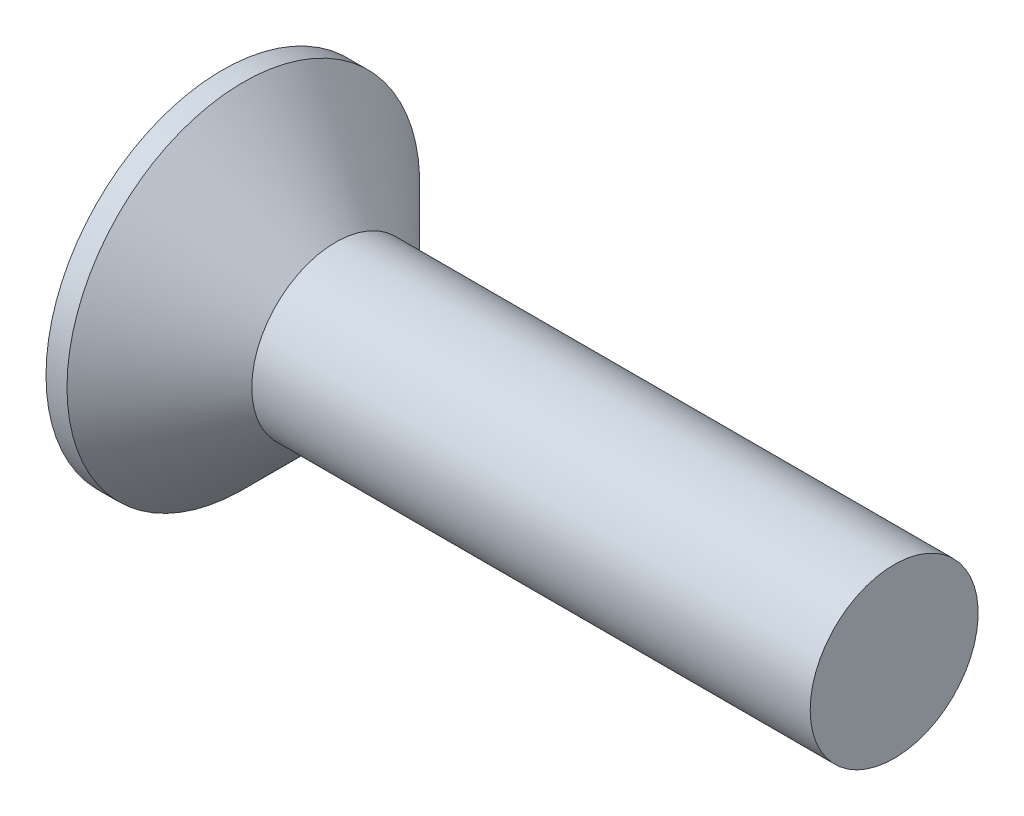
ISO-10303-21;
HEADER;
FILE_DESCRIPTION(('STEP AP214'),'2;1');
FILE_NAME('part.step','',(''),(''),'','','');
FILE_SCHEMA(('AUTOMOTIVE_DESIGN { 1 0 10303 214 1 1 1 1 }'));
ENDSEC;
DATA;
#1=APPLICATION_CONTEXT('core data for automotive mechanical design processes');
#2=APPLICATION_PROTOCOL_DEFINITION('international standard','automotive_design',2000,#1);
#3=PRODUCT_CONTEXT('',#1,'mechanical');
#4=PRODUCT('Part','Part','',(#3));
#5=PRODUCT_RELATED_PRODUCT_CATEGORY('part','',(#4));
#6=PRODUCT_DEFINITION_FORMATION('','',#4);
#7=PRODUCT_DEFINITION_CONTEXT('part definition',#1,'design');
#8=PRODUCT_DEFINITION('design','',#6,#7);
#9=PRODUCT_DEFINITION_SHAPE('','',#8);
#10=(LENGTH_UNIT() NAMED_UNIT(*) SI_UNIT(.MILLI.,.METRE.));
#11=(NAMED_UNIT(*) PLANE_ANGLE_UNIT() SI_UNIT($,.RADIAN.));
#12=(NAMED_UNIT(*) SI_UNIT($,.STERADIAN.) SOLID_ANGLE_UNIT());
#13=UNCERTAINTY_MEASURE_WITH_UNIT(LENGTH_MEASURE(1.E-05),#10,'distance_accuracy_value','');
#14=(GEOMETRIC_REPRESENTATION_CONTEXT(3) GLOBAL_UNCERTAINTY_ASSIGNED_CONTEXT((#13)) GLOBAL_UNIT_ASSIGNED_CONTEXT((#10,
#11,#12)) REPRESENTATION_CONTEXT('',''));
#15=CARTESIAN_POINT('',(0.,0.,0.));
#16=DIRECTION('',(0.,0.,1.));
#17=DIRECTION('',(1.,0.,0.));
#18=AXIS2_PLACEMENT_3D('',#15,#16,#17);
#19=CARTESIAN_POINT('',(0.,0.,0.));
#20=DIRECTION('',(-1.,0.,0.));
#21=DIRECTION('',(0.,0.,1.));
#22=AXIS2_PLACEMENT_3D('',#19,#20,#21);
#23=PLANE('',#22);
#24=CARTESIAN_POINT('',(0.,0.,0.));
#25=DIRECTION('',(-1.,0.,0.));
#26=DIRECTION('',(0.,0.,1.));
#27=AXIS2_PLACEMENT_3D('',#24,#25,#26);
#28=CIRCLE('',#27,4.2);
#29=CARTESIAN_POINT('',(0.,0.,4.2));
#30=VERTEX_POINT('',#29);
#31=EDGE_CURVE('E45',#30,#30,#28,.T.);
#32=ORIENTED_EDGE('',*,*,#31,.T.);
#33=EDGE_LOOP('',(#32));
#34=FACE_BOUND('',#33,.T.);
#35=DIRECTION('',(0.,1.,0.));
#36=VECTOR('',#35,1.);
#37=CARTESIAN_POINT('',(0.,-2.23,-0.48));
#38=LINE('',#37,#36);
#39=CARTESIAN_POINT('',(0.,-2.23,-0.48));
#40=VERTEX_POINT('',#39);
#41=CARTESIAN_POINT('',(0.,-0.479999999999998,-0.48));
#42=VERTEX_POINT('',#41);
#43=EDGE_CURVE('E106',#40,#42,#38,.T.);
#44=ORIENTED_EDGE('',*,*,#43,.T.);
#45=DIRECTION('',(0.,0.,-1.));
#46=VECTOR('',#45,1.);
#47=CARTESIAN_POINT('',(0.,-0.480000000000008,2.23));
#48=LINE('',#47,#46);
#49=CARTESIAN_POINT('',(0.,-0.479999999999992,-2.23));
#50=VERTEX_POINT('',#49);
#51=EDGE_CURVE('E86',#42,#50,#48,.T.);
#52=ORIENTED_EDGE('',*,*,#51,.T.);
#53=DIRECTION('',(0.,1.,0.));
#54=VECTOR('',#53,1.);
#55=CARTESIAN_POINT('',(0.,-0.479999999999992,-2.23));
#56=LINE('',#55,#54);
#57=CARTESIAN_POINT('',(0.,0.480000000000008,-2.23));
#58=VERTEX_POINT('',#57);
#59=EDGE_CURVE('E345',#50,#58,#56,.T.);
#60=ORIENTED_EDGE('',*,*,#59,.T.);
#61=DIRECTION('',(0.,0.,1.));
#62=VECTOR('',#61,1.);
#63=CARTESIAN_POINT('',(0.,0.480000000000008,-2.23));
#64=LINE('',#63,#62);
#65=CARTESIAN_POINT('',(0.,0.480000000000001,-0.48));
#66=VERTEX_POINT('',#65);
#67=EDGE_CURVE('E102',#58,#66,#64,.T.);
#68=ORIENTED_EDGE('',*,*,#67,.T.);
#69=CARTESIAN_POINT('',(0.,2.23,-0.48));
#70=VERTEX_POINT('',#69);
#71=EDGE_CURVE('E96',#66,#70,#38,.T.);
#72=ORIENTED_EDGE('',*,*,#71,.T.);
#73=DIRECTION('',(0.,0.,1.));
#74=VECTOR('',#73,1.);
#75=CARTESIAN_POINT('',(0.,2.23,-0.48));
#76=LINE('',#75,#74);
#77=CARTESIAN_POINT('',(0.,2.23,0.48));
#78=VERTEX_POINT('',#77);
#79=EDGE_CURVE('E99',#70,#78,#76,.T.);
#80=ORIENTED_EDGE('',*,*,#79,.T.);
#81=DIRECTION('',(0.,-1.,0.));
#82=VECTOR('',#81,1.);
#83=CARTESIAN_POINT('',(0.,2.23,0.48));
#84=LINE('',#83,#82);
#85=CARTESIAN_POINT('',(0.,0.479999999999998,0.48));
#86=VERTEX_POINT('',#85);
#87=EDGE_CURVE('E357',#78,#86,#84,.T.);
#88=ORIENTED_EDGE('',*,*,#87,.T.);
#89=CARTESIAN_POINT('',(0.,0.479999999999992,2.23));
#90=VERTEX_POINT('',#89);
#91=EDGE_CURVE('E340',#86,#90,#64,.T.);
#92=ORIENTED_EDGE('',*,*,#91,.T.);
#93=DIRECTION('',(0.,-1.,0.));
#94=VECTOR('',#93,1.);
#95=CARTESIAN_POINT('',(0.,0.479999999999992,2.23));
#96=LINE('',#95,#94);
#97=CARTESIAN_POINT('',(0.,-0.480000000000008,2.23));
#98=VERTEX_POINT('',#97);
#99=EDGE_CURVE('E326',#90,#98,#96,.T.);
#100=ORIENTED_EDGE('',*,*,#99,.T.);
#101=CARTESIAN_POINT('',(0.,-0.480000000000002,0.48));
#102=VERTEX_POINT('',#101);
#103=EDGE_CURVE('E338',#98,#102,#48,.T.);
#104=ORIENTED_EDGE('',*,*,#103,.T.);
#105=CARTESIAN_POINT('',(0.,-2.23,0.48));
#106=VERTEX_POINT('',#105);
#107=EDGE_CURVE('E112',#102,#106,#84,.T.);
#108=ORIENTED_EDGE('',*,*,#107,.T.);
#109=DIRECTION('',(0.,0.,-1.));
#110=VECTOR('',#109,1.);
#111=CARTESIAN_POINT('',(0.,-2.23,0.48));
#112=LINE('',#111,#110);
#113=EDGE_CURVE('E135',#106,#40,#112,.T.);
#114=ORIENTED_EDGE('',*,*,#113,.T.);
#115=EDGE_LOOP('',(#44,#52,#60,#68,#72,#80,#88,#92,#100,#104,#108,#114));
#116=FACE_BOUND('',#115,.T.);
#117=ADVANCED_FACE('F38',(#34,#116),#23,.T.);
#118=CARTESIAN_POINT('',(2.96959798994975,0.,0.211055276381909));
#119=DIRECTION('',(-0.0901968863789278,0.,-0.995923953767328));
#120=DIRECTION('',(-0.995923953767328,0.,0.0901968863789278));
#121=AXIS2_PLACEMENT_3D('',#118,#119,#120);
#122=PLANE('',#121);
#123=ORIENTED_EDGE('',*,*,#107,.F.);
#124=DIRECTION('',(0.991897347093265,0.0898322125669375,-0.0898322125669372));
#125=VECTOR('',#124,1.);
#126=CARTESIAN_POINT('',(2.98840392964726,-0.209352096937608,0.209352096937607));
#127=LINE('',#126,#125);
#128=CARTESIAN_POINT('',(2.65,-0.240000000000001,0.239999999999999));
#129=VERTEX_POINT('',#128);
#130=EDGE_CURVE('E130',#102,#129,#127,.T.);
#131=ORIENTED_EDGE('',*,*,#130,.T.);
#132=DIRECTION('',(0.797549052549738,0.59891419417886,-0.0722308575894103));
#133=VECTOR('',#132,1.);
#134=CARTESIAN_POINT('',(0.,-2.23,0.48));
#135=LINE('',#134,#133);
#136=EDGE_CURVE('E107',#106,#129,#135,.T.);
#137=ORIENTED_EDGE('',*,*,#136,.F.);
#138=EDGE_LOOP('',(#123,#131,#137));
#139=FACE_BOUND('',#138,.T.);
#140=ADVANCED_FACE('F158',(#139),#122,.T.);
#141=DIRECTION('',(0.797549052549738,-0.59891419417886,-0.0722308575894102));
#142=VECTOR('',#141,1.);
#143=CARTESIAN_POINT('',(0.,2.23,0.48));
#144=LINE('',#143,#142);
#145=CARTESIAN_POINT('',(2.65,0.24,0.24));
#146=VERTEX_POINT('',#145);
#147=EDGE_CURVE('E52',#78,#146,#144,.T.);
#148=ORIENTED_EDGE('',*,*,#147,.T.);
#149=DIRECTION('',(-0.991897347093265,0.0898322125669368,0.0898322125669372));
#150=VECTOR('',#149,1.);
#151=CARTESIAN_POINT('',(2.98840392964726,0.209352096937606,0.209352096937607));
#152=LINE('',#151,#150);
#153=EDGE_CURVE('E353',#146,#86,#152,.T.);
#154=ORIENTED_EDGE('',*,*,#153,.T.);
#155=ORIENTED_EDGE('',*,*,#87,.F.);
#156=EDGE_LOOP('',(#148,#154,#155));
#157=FACE_BOUND('',#156,.T.);
#158=ADVANCED_FACE('F162',(#157),#122,.T.);
#159=CARTESIAN_POINT('',(2.96959798994975,0.,-0.21105527638191));
#160=DIRECTION('',(-0.0901968863789277,0.,0.995923953767328));
#161=DIRECTION('',(0.995923953767328,0.,0.0901968863789277));
#162=AXIS2_PLACEMENT_3D('',#159,#160,#161);
#163=PLANE('',#162);
#164=DIRECTION('',(0.797549052549738,0.59891419417886,0.0722308575894102));
#165=VECTOR('',#164,1.);
#166=CARTESIAN_POINT('',(0.,-2.23,-0.48));
#167=LINE('',#166,#165);
#168=CARTESIAN_POINT('',(2.65,-0.239999999999999,-0.240000000000001));
#169=VERTEX_POINT('',#168);
#170=EDGE_CURVE('E61',#40,#169,#167,.T.);
#171=ORIENTED_EDGE('',*,*,#170,.T.);
#172=DIRECTION('',(-0.991897347093265,-0.0898322125669369,-0.0898322125669372));
#173=VECTOR('',#172,1.);
#174=CARTESIAN_POINT('',(2.98840392964726,-0.209352096937606,-0.209352096937607));
#175=LINE('',#174,#173);
#176=EDGE_CURVE('E11',#169,#42,#175,.T.);
#177=ORIENTED_EDGE('',*,*,#176,.T.);
#178=ORIENTED_EDGE('',*,*,#43,.F.);
#179=EDGE_LOOP('',(#171,#177,#178));
#180=FACE_BOUND('',#179,.T.);
#181=ADVANCED_FACE('F155',(#180),#163,.T.);
#182=ORIENTED_EDGE('',*,*,#71,.F.);
#183=DIRECTION('',(0.991897347093265,-0.0898322125669375,0.0898322125669371));
#184=VECTOR('',#183,1.);
#185=CARTESIAN_POINT('',(2.98840392964726,0.209352096937608,-0.209352096937607));
#186=LINE('',#185,#184);
#187=CARTESIAN_POINT('',(2.65,0.24,-0.24));
#188=VERTEX_POINT('',#187);
#189=EDGE_CURVE('E115',#66,#188,#186,.T.);
#190=ORIENTED_EDGE('',*,*,#189,.T.);
#191=DIRECTION('',(0.797549052549738,-0.59891419417886,0.0722308575894102));
#192=VECTOR('',#191,1.);
#193=CARTESIAN_POINT('',(0.,2.23,-0.48));
#194=LINE('',#193,#192);
#195=EDGE_CURVE('E111',#70,#188,#194,.T.);
#196=ORIENTED_EDGE('',*,*,#195,.F.);
#197=EDGE_LOOP('',(#182,#190,#196));
#198=FACE_BOUND('',#197,.T.);
#199=ADVANCED_FACE('F114',(#198),#163,.T.);
#200=CARTESIAN_POINT('',(-6.34999999999999,0.,0.));
#201=DIRECTION('',(-1.,0.,0.));
#202=DIRECTION('',(0.,0.,1.));
#203=AXIS2_PLACEMENT_3D('',#200,#201,#202);
#204=CYLINDRICAL_SURFACE('',#203,4.2);
#205=CARTESIAN_POINT('',(0.500000000000007,0.,0.));
#206=DIRECTION('',(-1.,0.,0.));
#207=DIRECTION('',(0.,0.,1.));
#208=AXIS2_PLACEMENT_3D('',#205,#206,#207);
#209=CIRCLE('',#208,4.2);
#210=CARTESIAN_POINT('',(0.500000000000007,0.,4.2));
#211=VERTEX_POINT('',#210);
#212=EDGE_CURVE('E138',#211,#211,#209,.T.);
#213=ORIENTED_EDGE('',*,*,#212,.T.);
#214=EDGE_LOOP('',(#213));
#215=FACE_BOUND('',#214,.T.);
#216=ORIENTED_EDGE('',*,*,#31,.F.);
#217=EDGE_LOOP('',(#216));
#218=FACE_BOUND('',#217,.T.);
#219=ADVANCED_FACE('F144',(#215,#218),#204,.T.);
#220=CARTESIAN_POINT('',(0.500000000000007,0.,0.));
#221=DIRECTION('',(-1.,0.,0.));
#222=DIRECTION('',(0.,0.,1.));
#223=AXIS2_PLACEMENT_3D('',#220,#221,#222);
#224=CONICAL_SURFACE('',#223,4.2,0.78539816339745);
#225=CARTESIAN_POINT('',(2.7,0.,0.));
#226=DIRECTION('',(-1.,0.,0.));
#227=DIRECTION('',(0.,0.,1.));
#228=AXIS2_PLACEMENT_3D('',#225,#226,#227);
#229=CIRCLE('',#228,2.);
#230=CARTESIAN_POINT('',(2.7,0.,2.));
#231=VERTEX_POINT('',#230);
#232=EDGE_CURVE('E134',#231,#231,#229,.T.);
#233=ORIENTED_EDGE('',*,*,#232,.T.);
#234=EDGE_LOOP('',(#233));
#235=FACE_BOUND('',#234,.T.);
#236=ORIENTED_EDGE('',*,*,#212,.F.);
#237=EDGE_LOOP('',(#236));
#238=FACE_BOUND('',#237,.T.);
#239=ADVANCED_FACE('F146',(#235,#238),#224,.T.);
#240=CARTESIAN_POINT('',(-6.34999999999999,0.,0.));
#241=DIRECTION('',(-1.,0.,0.));
#242=DIRECTION('',(0.,0.,1.));
#243=AXIS2_PLACEMENT_3D('',#240,#241,#242);
#244=CYLINDRICAL_SURFACE('',#243,2.);
#245=CARTESIAN_POINT('',(16.,0.,0.));
#246=DIRECTION('',(-1.,0.,0.));
#247=DIRECTION('',(0.,0.,1.));
#248=AXIS2_PLACEMENT_3D('',#245,#246,#247);
#249=CIRCLE('',#248,2.);
#250=CARTESIAN_POINT('',(16.,0.,2.));
#251=VERTEX_POINT('',#250);
#252=EDGE_CURVE('E131',#251,#251,#249,.T.);
#253=ORIENTED_EDGE('',*,*,#252,.T.);
#254=EDGE_LOOP('',(#253));
#255=FACE_BOUND('',#254,.T.);
#256=ORIENTED_EDGE('',*,*,#232,.F.);
#257=EDGE_LOOP('',(#256));
#258=FACE_BOUND('',#257,.T.);
#259=ADVANCED_FACE('F152',(#255,#258),#244,.T.);
#260=CARTESIAN_POINT('',(16.,2.,0.));
#261=DIRECTION('',(1.,0.,0.));
#262=DIRECTION('',(0.,0.,-1.));
#263=AXIS2_PLACEMENT_3D('',#260,#261,#262);
#264=PLANE('',#263);
#265=ORIENTED_EDGE('',*,*,#252,.F.);
#266=EDGE_LOOP('',(#265));
#267=FACE_BOUND('',#266,.T.);
#268=ADVANCED_FACE('F182',(#267),#264,.T.);
#269=CARTESIAN_POINT('',(2.65,0.24,-0.24));
#270=DIRECTION('',(1.,0.,0.));
#271=DIRECTION('',(0.,0.,-1.));
#272=AXIS2_PLACEMENT_3D('',#269,#270,#271);
#273=PLANE('',#272);
#274=DIRECTION('',(0.,1.,0.));
#275=VECTOR('',#274,1.);
#276=CARTESIAN_POINT('',(2.65,-0.24,-0.24));
#277=LINE('',#276,#275);
#278=EDGE_CURVE('E126',#169,#188,#277,.T.);
#279=ORIENTED_EDGE('',*,*,#278,.F.);
#280=DIRECTION('',(0.,0.,-1.));
#281=VECTOR('',#280,1.);
#282=CARTESIAN_POINT('',(2.65,-0.24,0.24));
#283=LINE('',#282,#281);
#284=EDGE_CURVE('E117',#129,#169,#283,.T.);
#285=ORIENTED_EDGE('',*,*,#284,.F.);
#286=DIRECTION('',(0.,-1.,0.));
#287=VECTOR('',#286,1.);
#288=CARTESIAN_POINT('',(2.65,0.24,0.24));
#289=LINE('',#288,#287);
#290=EDGE_CURVE('E120',#146,#129,#289,.T.);
#291=ORIENTED_EDGE('',*,*,#290,.F.);
#292=DIRECTION('',(0.,0.,1.));
#293=VECTOR('',#292,1.);
#294=CARTESIAN_POINT('',(2.65,0.24,-0.24));
#295=LINE('',#294,#293);
#296=EDGE_CURVE('E124',#188,#146,#295,.T.);
#297=ORIENTED_EDGE('',*,*,#296,.F.);
#298=EDGE_LOOP('',(#279,#285,#291,#297));
#299=FACE_BOUND('',#298,.T.);
#300=ADVANCED_FACE('F179',(#299),#273,.F.);
#301=CARTESIAN_POINT('',(0.,-2.23,-0.48));
#302=DIRECTION('',(-0.600482690889725,0.799637754199885,0.));
#303=DIRECTION('',(-0.799637754199885,-0.600482690889725,0.));
#304=AXIS2_PLACEMENT_3D('',#301,#302,#303);
#305=PLANE('',#304);
#306=ORIENTED_EDGE('',*,*,#170,.F.);
#307=ORIENTED_EDGE('',*,*,#113,.F.);
#308=ORIENTED_EDGE('',*,*,#136,.T.);
#309=ORIENTED_EDGE('',*,*,#284,.T.);
#310=EDGE_LOOP('',(#306,#307,#308,#309));
#311=FACE_BOUND('',#310,.T.);
#312=ADVANCED_FACE('F171',(#311),#305,.T.);
#313=CARTESIAN_POINT('',(2.65,0.24,0.24));
#314=DIRECTION('',(-0.600482690889725,-0.799637754199885,0.));
#315=DIRECTION('',(0.799637754199885,-0.600482690889725,0.));
#316=AXIS2_PLACEMENT_3D('',#313,#314,#315);
#317=PLANE('',#316);
#318=ORIENTED_EDGE('',*,*,#147,.F.);
#319=ORIENTED_EDGE('',*,*,#79,.F.);
#320=ORIENTED_EDGE('',*,*,#195,.T.);
#321=ORIENTED_EDGE('',*,*,#296,.T.);
#322=EDGE_LOOP('',(#318,#319,#320,#321));
#323=FACE_BOUND('',#322,.T.);
#324=ADVANCED_FACE('F110',(#323),#317,.T.);
#325=CARTESIAN_POINT('',(2.96959798994975,-0.211055276381909,0.));
#326=DIRECTION('',(-0.0901968863789278,0.995923953767328,0.));
#327=DIRECTION('',(-0.995923953767328,-0.0901968863789278,0.));
#328=AXIS2_PLACEMENT_3D('',#325,#326,#327);
#329=PLANE('',#328);
#330=DIRECTION('',(0.797549052549738,0.0722308575894082,0.59891419417886));
#331=VECTOR('',#330,1.);
#332=CARTESIAN_POINT('',(0.,-0.479999999999992,-2.23));
#333=LINE('',#332,#331);
#334=EDGE_CURVE('E347',#50,#169,#333,.T.);
#335=ORIENTED_EDGE('',*,*,#334,.F.);
#336=ORIENTED_EDGE('',*,*,#51,.F.);
#337=ORIENTED_EDGE('',*,*,#176,.F.);
#338=EDGE_LOOP('',(#335,#336,#337));
#339=FACE_BOUND('',#338,.T.);
#340=ADVANCED_FACE('F178',(#339),#329,.T.);
#341=CARTESIAN_POINT('',(2.96959798994975,0.21105527638191,0.));
#342=DIRECTION('',(-0.0901968863789277,-0.995923953767328,0.));
#343=DIRECTION('',(0.995923953767328,-0.0901968863789277,0.));
#344=AXIS2_PLACEMENT_3D('',#341,#342,#343);
#345=PLANE('',#344);
#346=ORIENTED_EDGE('',*,*,#67,.F.);
#347=DIRECTION('',(0.797549052549738,-0.0722308575894123,0.59891419417886));
#348=VECTOR('',#347,1.);
#349=CARTESIAN_POINT('',(0.,0.480000000000008,-2.23));
#350=LINE('',#349,#348);
#351=EDGE_CURVE('E77',#58,#188,#350,.T.);
#352=ORIENTED_EDGE('',*,*,#351,.T.);
#353=ORIENTED_EDGE('',*,*,#189,.F.);
#354=EDGE_LOOP('',(#346,#352,#353));
#355=FACE_BOUND('',#354,.T.);
#356=ADVANCED_FACE('F223',(#355),#345,.T.);
#357=CARTESIAN_POINT('',(0.,0.480000000000008,-2.23));
#358=DIRECTION('',(-0.600482690889725,0.,0.799637754199885));
#359=DIRECTION('',(-0.799637754199885,0.,-0.600482690889725));
#360=AXIS2_PLACEMENT_3D('',#357,#358,#359);
#361=PLANE('',#360);
#362=ORIENTED_EDGE('',*,*,#351,.F.);
#363=ORIENTED_EDGE('',*,*,#59,.F.);
#364=ORIENTED_EDGE('',*,*,#334,.T.);
#365=ORIENTED_EDGE('',*,*,#278,.T.);
#366=EDGE_LOOP('',(#362,#363,#364,#365));
#367=FACE_BOUND('',#366,.T.);
#368=ADVANCED_FACE('F231',(#367),#361,.T.);
#369=ORIENTED_EDGE('',*,*,#103,.F.);
#370=DIRECTION('',(0.797549052549738,0.0722308575894123,-0.59891419417886));
#371=VECTOR('',#370,1.);
#372=CARTESIAN_POINT('',(0.,-0.480000000000008,2.23));
#373=LINE('',#372,#371);
#374=EDGE_CURVE('E323',#98,#129,#373,.T.);
#375=ORIENTED_EDGE('',*,*,#374,.T.);
#376=ORIENTED_EDGE('',*,*,#130,.F.);
#377=EDGE_LOOP('',(#369,#375,#376));
#378=FACE_BOUND('',#377,.T.);
#379=ADVANCED_FACE('F225',(#378),#329,.T.);
#380=DIRECTION('',(0.797549052549738,-0.0722308575894081,-0.59891419417886));
#381=VECTOR('',#380,1.);
#382=CARTESIAN_POINT('',(0.,0.479999999999992,2.23));
#383=LINE('',#382,#381);
#384=EDGE_CURVE('E334',#90,#146,#383,.T.);
#385=ORIENTED_EDGE('',*,*,#384,.F.);
#386=ORIENTED_EDGE('',*,*,#91,.F.);
#387=ORIENTED_EDGE('',*,*,#153,.F.);
#388=EDGE_LOOP('',(#385,#386,#387));
#389=FACE_BOUND('',#388,.T.);
#390=ADVANCED_FACE('F233',(#389),#345,.T.);
#391=CARTESIAN_POINT('',(2.65,-0.240000000000001,0.239999999999999));
#392=DIRECTION('',(-0.600482690889725,0.,-0.799637754199885));
#393=DIRECTION('',(0.799637754199885,0.,-0.600482690889725));
#394=AXIS2_PLACEMENT_3D('',#391,#392,#393);
#395=PLANE('',#394);
#396=ORIENTED_EDGE('',*,*,#374,.F.);
#397=ORIENTED_EDGE('',*,*,#99,.F.);
#398=ORIENTED_EDGE('',*,*,#384,.T.);
#399=ORIENTED_EDGE('',*,*,#290,.T.);
#400=EDGE_LOOP('',(#396,#397,#398,#399));
#401=FACE_BOUND('',#400,.T.);
#402=ADVANCED_FACE('F252',(#401),#395,.T.);
#403=CLOSED_SHELL('',(#117,#140,#158,#181,#199,#219,#239,#259,#268,#300,#312,#324,#340,#356,
#368,#379,#390,#402));
#404=MANIFOLD_SOLID_BREP('B2',#403);
#405=ADVANCED_BREP_SHAPE_REPRESENTATION('',(#18,#404),#14);
#406=SHAPE_DEFINITION_REPRESENTATION(#9,#405);
ENDSEC;
END-ISO-10303-21;
